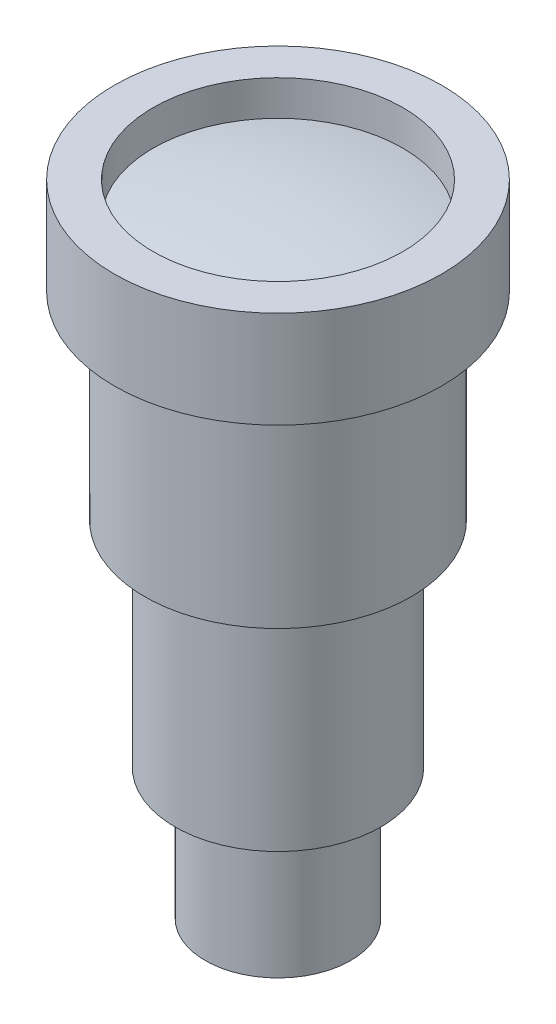
ISO-10303-21;
HEADER;
FILE_DESCRIPTION(('STEP AP214'),'2;1');
FILE_NAME('part.step','',(''),(''),'','','');
FILE_SCHEMA(('AUTOMOTIVE_DESIGN { 1 0 10303 214 1 1 1 1 }'));
ENDSEC;
DATA;
#1=APPLICATION_CONTEXT('core data for automotive mechanical design processes');
#2=APPLICATION_PROTOCOL_DEFINITION('international standard','automotive_design',2000,#1);
#3=PRODUCT_CONTEXT('',#1,'mechanical');
#4=PRODUCT('Part','Part','',(#3));
#5=PRODUCT_RELATED_PRODUCT_CATEGORY('part','',(#4));
#6=PRODUCT_DEFINITION_FORMATION('','',#4);
#7=PRODUCT_DEFINITION_CONTEXT('part definition',#1,'design');
#8=PRODUCT_DEFINITION('design','',#6,#7);
#9=PRODUCT_DEFINITION_SHAPE('','',#8);
#10=(LENGTH_UNIT() NAMED_UNIT(*) SI_UNIT(.MILLI.,.METRE.));
#11=(NAMED_UNIT(*) PLANE_ANGLE_UNIT() SI_UNIT($,.RADIAN.));
#12=(NAMED_UNIT(*) SI_UNIT($,.STERADIAN.) SOLID_ANGLE_UNIT());
#13=UNCERTAINTY_MEASURE_WITH_UNIT(LENGTH_MEASURE(1.E-05),#10,'distance_accuracy_value','');
#14=(GEOMETRIC_REPRESENTATION_CONTEXT(3) GLOBAL_UNCERTAINTY_ASSIGNED_CONTEXT((#13)) GLOBAL_UNIT_ASSIGNED_CONTEXT((#10,
#11,#12)) REPRESENTATION_CONTEXT('',''));
#15=CARTESIAN_POINT('',(0.,0.,0.));
#16=DIRECTION('',(0.,0.,1.));
#17=DIRECTION('',(1.,0.,0.));
#18=AXIS2_PLACEMENT_3D('',#15,#16,#17);
#19=CARTESIAN_POINT('',(0.,30.,0.));
#20=DIRECTION('',(0.,-1.,0.));
#21=DIRECTION('',(0.,0.,-1.));
#22=AXIS2_PLACEMENT_3D('',#19,#20,#21);
#23=PLANE('',#22);
#24=CARTESIAN_POINT('',(0.,30.,0.));
#25=DIRECTION('',(0.,-1.,0.));
#26=DIRECTION('',(0.,0.,-1.));
#27=AXIS2_PLACEMENT_3D('',#24,#25,#26);
#28=CIRCLE('',#27,5.);
#29=CARTESIAN_POINT('',(0.,30.,-5.));
#30=VERTEX_POINT('',#29);
#31=EDGE_CURVE('E27',#30,#30,#28,.T.);
#32=ORIENTED_EDGE('',*,*,#31,.T.);
#33=EDGE_LOOP('',(#32));
#34=FACE_BOUND('',#33,.T.);
#35=ADVANCED_FACE('F24',(#34),#23,.T.);
#36=CARTESIAN_POINT('',(0.,30.,0.));
#37=DIRECTION('',(0.,-1.,0.));
#38=DIRECTION('',(0.,0.,-1.));
#39=AXIS2_PLACEMENT_3D('',#36,#37,#38);
#40=CYLINDRICAL_SURFACE('',#39,5.);
#41=ORIENTED_EDGE('',*,*,#31,.F.);
#42=EDGE_LOOP('',(#41));
#43=FACE_BOUND('',#42,.T.);
#44=CARTESIAN_POINT('',(0.,0.,0.));
#45=DIRECTION('',(0.,-1.,0.));
#46=DIRECTION('',(0.,0.,-1.));
#47=AXIS2_PLACEMENT_3D('',#44,#45,#46);
#48=CIRCLE('',#47,5.);
#49=CARTESIAN_POINT('',(0.,0.,-5.));
#50=VERTEX_POINT('',#49);
#51=EDGE_CURVE('E69',#50,#50,#48,.T.);
#52=ORIENTED_EDGE('',*,*,#51,.T.);
#53=EDGE_LOOP('',(#52));
#54=FACE_BOUND('',#53,.T.);
#55=ADVANCED_FACE('F77',(#43,#54),#40,.F.);
#56=CARTESIAN_POINT('',(0.,0.,0.));
#57=DIRECTION('',(0.,1.,0.));
#58=DIRECTION('',(0.,0.,1.));
#59=AXIS2_PLACEMENT_3D('',#56,#57,#58);
#60=PLANE('',#59);
#61=CARTESIAN_POINT('',(0.,0.,0.));
#62=DIRECTION('',(0.,-1.,0.));
#63=DIRECTION('',(0.,0.,-1.));
#64=AXIS2_PLACEMENT_3D('',#61,#62,#63);
#65=CIRCLE('',#64,6.);
#66=CARTESIAN_POINT('',(0.,0.,-6.));
#67=VERTEX_POINT('',#66);
#68=EDGE_CURVE('E67',#67,#67,#65,.F.);
#69=ORIENTED_EDGE('',*,*,#68,.F.);
#70=EDGE_LOOP('',(#69));
#71=FACE_BOUND('',#70,.T.);
#72=ORIENTED_EDGE('',*,*,#51,.F.);
#73=EDGE_LOOP('',(#72));
#74=FACE_BOUND('',#73,.T.);
#75=ADVANCED_FACE('F79',(#71,#74),#60,.F.);
#76=CARTESIAN_POINT('',(0.,0.,0.));
#77=DIRECTION('',(0.,-1.,0.));
#78=DIRECTION('',(0.,0.,-1.));
#79=AXIS2_PLACEMENT_3D('',#76,#77,#78);
#80=CYLINDRICAL_SURFACE('',#79,6.);
#81=ORIENTED_EDGE('',*,*,#68,.T.);
#82=EDGE_LOOP('',(#81));
#83=FACE_BOUND('',#82,.T.);
#84=CARTESIAN_POINT('',(0.,10.,0.));
#85=DIRECTION('',(0.,-1.,0.));
#86=DIRECTION('',(0.,0.,-1.));
#87=AXIS2_PLACEMENT_3D('',#84,#85,#86);
#88=CIRCLE('',#87,6.);
#89=CARTESIAN_POINT('',(0.,10.,-6.));
#90=VERTEX_POINT('',#89);
#91=EDGE_CURVE('E64',#90,#90,#88,.T.);
#92=ORIENTED_EDGE('',*,*,#91,.T.);
#93=EDGE_LOOP('',(#92));
#94=FACE_BOUND('',#93,.T.);
#95=ADVANCED_FACE('F85',(#83,#94),#80,.T.);
#96=CARTESIAN_POINT('',(0.,0.,0.));
#97=DIRECTION('',(1.,0.,0.));
#98=DIRECTION('',(0.,1.,0.));
#99=AXIS2_PLACEMENT_3D('',#96,#97,#98);
#100=SPHERICAL_SURFACE('',#99,50.9519381378177);
#101=CARTESIAN_POINT('',(0.,49.9,0.));
#102=DIRECTION('',(0.,-1.,0.));
#103=DIRECTION('',(0.,0.,-1.));
#104=AXIS2_PLACEMENT_3D('',#101,#102,#103);
#105=CIRCLE('',#104,10.3);
#106=CARTESIAN_POINT('',(0.,49.9,-10.3));
#107=VERTEX_POINT('',#106);
#108=EDGE_CURVE('E61',#107,#107,#105,.F.);
#109=ORIENTED_EDGE('',*,*,#108,.T.);
#110=EDGE_LOOP('',(#109));
#111=FACE_BOUND('',#110,.T.);
#112=ADVANCED_FACE('F130',(#111),#100,.T.);
#113=CARTESIAN_POINT('',(-6.,10.,0.));
#114=DIRECTION('',(0.,-1.,0.));
#115=DIRECTION('',(0.,0.,-1.));
#116=AXIS2_PLACEMENT_3D('',#113,#114,#115);
#117=PLANE('',#116);
#118=CARTESIAN_POINT('',(0.,10.,0.));
#119=DIRECTION('',(0.,-1.,0.));
#120=DIRECTION('',(0.,0.,-1.));
#121=AXIS2_PLACEMENT_3D('',#118,#119,#120);
#122=CIRCLE('',#121,5.6);
#123=CARTESIAN_POINT('',(0.,10.,-5.6));
#124=VERTEX_POINT('',#123);
#125=EDGE_CURVE('E58',#124,#124,#122,.F.);
#126=ORIENTED_EDGE('',*,*,#125,.F.);
#127=EDGE_LOOP('',(#126));
#128=FACE_BOUND('',#127,.T.);
#129=ORIENTED_EDGE('',*,*,#91,.F.);
#130=EDGE_LOOP('',(#129));
#131=FACE_BOUND('',#130,.T.);
#132=ADVANCED_FACE('F126',(#128,#131),#117,.F.);
#133=CARTESIAN_POINT('',(0.,0.,0.));
#134=DIRECTION('',(0.,-1.,0.));
#135=DIRECTION('',(0.,0.,-1.));
#136=AXIS2_PLACEMENT_3D('',#133,#134,#135);
#137=CYLINDRICAL_SURFACE('',#136,10.3);
#138=CARTESIAN_POINT('',(0.,52.8,0.));
#139=DIRECTION('',(0.,-1.,0.));
#140=DIRECTION('',(0.,0.,-1.));
#141=AXIS2_PLACEMENT_3D('',#138,#139,#140);
#142=CIRCLE('',#141,10.3);
#143=CARTESIAN_POINT('',(0.,52.8,-10.3));
#144=VERTEX_POINT('',#143);
#145=EDGE_CURVE('E55',#144,#144,#142,.F.);
#146=ORIENTED_EDGE('',*,*,#145,.T.);
#147=EDGE_LOOP('',(#146));
#148=FACE_BOUND('',#147,.T.);
#149=ORIENTED_EDGE('',*,*,#108,.F.);
#150=EDGE_LOOP('',(#149));
#151=FACE_BOUND('',#150,.T.);
#152=ADVANCED_FACE('F122',(#148,#151),#137,.F.);
#153=CARTESIAN_POINT('',(0.,0.,0.));
#154=DIRECTION('',(0.,-1.,0.));
#155=DIRECTION('',(0.,0.,-1.));
#156=AXIS2_PLACEMENT_3D('',#153,#154,#155);
#157=CYLINDRICAL_SURFACE('',#156,5.6);
#158=ORIENTED_EDGE('',*,*,#125,.T.);
#159=EDGE_LOOP('',(#158));
#160=FACE_BOUND('',#159,.T.);
#161=CARTESIAN_POINT('',(0.,10.8,0.));
#162=DIRECTION('',(0.,-1.,0.));
#163=DIRECTION('',(0.,0.,-1.));
#164=AXIS2_PLACEMENT_3D('',#161,#162,#163);
#165=CIRCLE('',#164,5.6);
#166=CARTESIAN_POINT('',(0.,10.8,-5.6));
#167=VERTEX_POINT('',#166);
#168=EDGE_CURVE('E52',#167,#167,#165,.T.);
#169=ORIENTED_EDGE('',*,*,#168,.T.);
#170=EDGE_LOOP('',(#169));
#171=FACE_BOUND('',#170,.T.);
#172=ADVANCED_FACE('F118',(#160,#171),#157,.T.);
#173=CARTESIAN_POINT('',(-13.5,52.8,0.));
#174=DIRECTION('',(0.,-1.,0.));
#175=DIRECTION('',(0.,0.,-1.));
#176=AXIS2_PLACEMENT_3D('',#173,#174,#175);
#177=PLANE('',#176);
#178=ORIENTED_EDGE('',*,*,#145,.F.);
#179=EDGE_LOOP('',(#178));
#180=FACE_BOUND('',#179,.T.);
#181=CARTESIAN_POINT('',(0.,52.8,0.));
#182=DIRECTION('',(0.,-1.,0.));
#183=DIRECTION('',(0.,0.,-1.));
#184=AXIS2_PLACEMENT_3D('',#181,#182,#183);
#185=CIRCLE('',#184,13.5);
#186=CARTESIAN_POINT('',(0.,52.8,-13.5));
#187=VERTEX_POINT('',#186);
#188=EDGE_CURVE('E49',#187,#187,#185,.T.);
#189=ORIENTED_EDGE('',*,*,#188,.F.);
#190=EDGE_LOOP('',(#189));
#191=FACE_BOUND('',#190,.T.);
#192=ADVANCED_FACE('F114',(#180,#191),#177,.F.);
#193=CARTESIAN_POINT('',(-5.6,10.8,0.));
#194=DIRECTION('',(0.,1.,0.));
#195=DIRECTION('',(0.,0.,1.));
#196=AXIS2_PLACEMENT_3D('',#193,#194,#195);
#197=PLANE('',#196);
#198=CARTESIAN_POINT('',(0.,10.8,0.));
#199=DIRECTION('',(0.,-1.,0.));
#200=DIRECTION('',(0.,0.,-1.));
#201=AXIS2_PLACEMENT_3D('',#198,#199,#200);
#202=CIRCLE('',#201,8.5);
#203=CARTESIAN_POINT('',(0.,10.8,-8.5));
#204=VERTEX_POINT('',#203);
#205=EDGE_CURVE('E46',#204,#204,#202,.F.);
#206=ORIENTED_EDGE('',*,*,#205,.F.);
#207=EDGE_LOOP('',(#206));
#208=FACE_BOUND('',#207,.T.);
#209=ORIENTED_EDGE('',*,*,#168,.F.);
#210=EDGE_LOOP('',(#209));
#211=FACE_BOUND('',#210,.T.);
#212=ADVANCED_FACE('F110',(#208,#211),#197,.F.);
#213=CARTESIAN_POINT('',(0.,0.,0.));
#214=DIRECTION('',(0.,-1.,0.));
#215=DIRECTION('',(0.,0.,-1.));
#216=AXIS2_PLACEMENT_3D('',#213,#214,#215);
#217=CYLINDRICAL_SURFACE('',#216,13.5);
#218=CARTESIAN_POINT('',(0.,44.8,0.));
#219=DIRECTION('',(0.,-1.,0.));
#220=DIRECTION('',(0.,0.,-1.));
#221=AXIS2_PLACEMENT_3D('',#218,#219,#220);
#222=CIRCLE('',#221,13.5);
#223=CARTESIAN_POINT('',(0.,44.8,-13.5));
#224=VERTEX_POINT('',#223);
#225=EDGE_CURVE('E43',#224,#224,#222,.F.);
#226=ORIENTED_EDGE('',*,*,#225,.T.);
#227=EDGE_LOOP('',(#226));
#228=FACE_BOUND('',#227,.T.);
#229=ORIENTED_EDGE('',*,*,#188,.T.);
#230=EDGE_LOOP('',(#229));
#231=FACE_BOUND('',#230,.T.);
#232=ADVANCED_FACE('F106',(#228,#231),#217,.T.);
#233=CARTESIAN_POINT('',(0.,0.,0.));
#234=DIRECTION('',(0.,-1.,0.));
#235=DIRECTION('',(0.,0.,-1.));
#236=AXIS2_PLACEMENT_3D('',#233,#234,#235);
#237=CYLINDRICAL_SURFACE('',#236,8.5);
#238=ORIENTED_EDGE('',*,*,#205,.T.);
#239=EDGE_LOOP('',(#238));
#240=FACE_BOUND('',#239,.T.);
#241=CARTESIAN_POINT('',(0.,28.5,0.));
#242=DIRECTION('',(0.,-1.,0.));
#243=DIRECTION('',(0.,0.,-1.));
#244=AXIS2_PLACEMENT_3D('',#241,#242,#243);
#245=CIRCLE('',#244,8.5);
#246=CARTESIAN_POINT('',(0.,28.5,-8.5));
#247=VERTEX_POINT('',#246);
#248=EDGE_CURVE('E36',#247,#247,#245,.T.);
#249=ORIENTED_EDGE('',*,*,#248,.T.);
#250=EDGE_LOOP('',(#249));
#251=FACE_BOUND('',#250,.T.);
#252=ADVANCED_FACE('F102',(#240,#251),#237,.T.);
#253=CARTESIAN_POINT('',(-11.,44.8,0.));
#254=DIRECTION('',(0.,1.,0.));
#255=DIRECTION('',(0.,0.,1.));
#256=AXIS2_PLACEMENT_3D('',#253,#254,#255);
#257=PLANE('',#256);
#258=ORIENTED_EDGE('',*,*,#225,.F.);
#259=EDGE_LOOP('',(#258));
#260=FACE_BOUND('',#259,.T.);
#261=CARTESIAN_POINT('',(0.,44.8,0.));
#262=DIRECTION('',(0.,-1.,0.));
#263=DIRECTION('',(0.,0.,-1.));
#264=AXIS2_PLACEMENT_3D('',#261,#262,#263);
#265=CIRCLE('',#264,11.);
#266=CARTESIAN_POINT('',(0.,44.8,-11.));
#267=VERTEX_POINT('',#266);
#268=EDGE_CURVE('E31',#267,#267,#265,.T.);
#269=ORIENTED_EDGE('',*,*,#268,.F.);
#270=EDGE_LOOP('',(#269));
#271=FACE_BOUND('',#270,.T.);
#272=ADVANCED_FACE('F95',(#260,#271),#257,.F.);
#273=CARTESIAN_POINT('',(-8.5,28.5,0.));
#274=DIRECTION('',(0.,1.,0.));
#275=DIRECTION('',(0.,0.,1.));
#276=AXIS2_PLACEMENT_3D('',#273,#274,#275);
#277=PLANE('',#276);
#278=CARTESIAN_POINT('',(0.,28.5,0.));
#279=DIRECTION('',(0.,-1.,0.));
#280=DIRECTION('',(0.,0.,-1.));
#281=AXIS2_PLACEMENT_3D('',#278,#279,#280);
#282=CIRCLE('',#281,11.);
#283=CARTESIAN_POINT('',(0.,28.5,-11.));
#284=VERTEX_POINT('',#283);
#285=EDGE_CURVE('E12',#284,#284,#282,.F.);
#286=ORIENTED_EDGE('',*,*,#285,.F.);
#287=EDGE_LOOP('',(#286));
#288=FACE_BOUND('',#287,.T.);
#289=ORIENTED_EDGE('',*,*,#248,.F.);
#290=EDGE_LOOP('',(#289));
#291=FACE_BOUND('',#290,.T.);
#292=ADVANCED_FACE('F90',(#288,#291),#277,.F.);
#293=CARTESIAN_POINT('',(0.,0.,0.));
#294=DIRECTION('',(0.,-1.,0.));
#295=DIRECTION('',(0.,0.,-1.));
#296=AXIS2_PLACEMENT_3D('',#293,#294,#295);
#297=CYLINDRICAL_SURFACE('',#296,11.);
#298=ORIENTED_EDGE('',*,*,#285,.T.);
#299=EDGE_LOOP('',(#298));
#300=FACE_BOUND('',#299,.T.);
#301=ORIENTED_EDGE('',*,*,#268,.T.);
#302=EDGE_LOOP('',(#301));
#303=FACE_BOUND('',#302,.T.);
#304=ADVANCED_FACE('F88',(#300,#303),#297,.T.);
#305=CLOSED_SHELL('',(#35,#55,#75,#95,#112,#132,#152,#172,#192,#212,#232,#252,#272,#292,#304));
#306=MANIFOLD_SOLID_BREP('B1',#305);
#307=ADVANCED_BREP_SHAPE_REPRESENTATION('',(#18,#306),#14);
#308=SHAPE_DEFINITION_REPRESENTATION(#9,#307);
ENDSEC;
END-ISO-10303-21;
